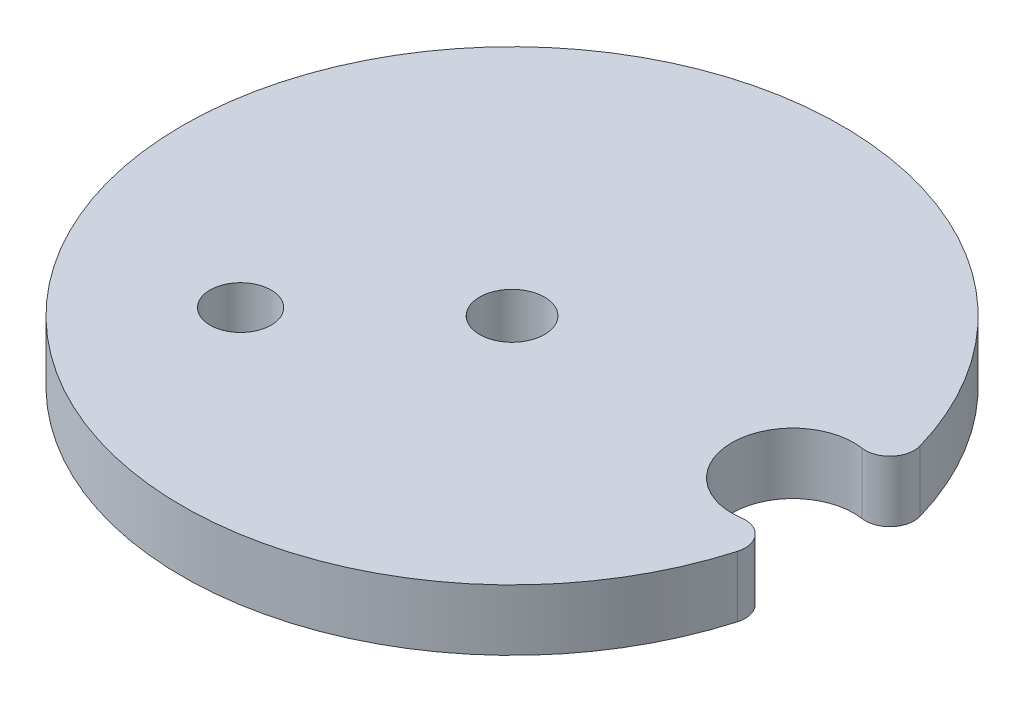
ISO-10303-21;
HEADER;
FILE_DESCRIPTION(('STEP AP214'),'2;1');
FILE_NAME('part.step','',(''),(''),'','','');
FILE_SCHEMA(('AUTOMOTIVE_DESIGN { 1 0 10303 214 1 1 1 1 }'));
ENDSEC;
DATA;
#1=APPLICATION_CONTEXT('core data for automotive mechanical design processes');
#2=APPLICATION_PROTOCOL_DEFINITION('international standard','automotive_design',2000,#1);
#3=PRODUCT_CONTEXT('',#1,'mechanical');
#4=PRODUCT('Part','Part','',(#3));
#5=PRODUCT_RELATED_PRODUCT_CATEGORY('part','',(#4));
#6=PRODUCT_DEFINITION_FORMATION('','',#4);
#7=PRODUCT_DEFINITION_CONTEXT('part definition',#1,'design');
#8=PRODUCT_DEFINITION('design','',#6,#7);
#9=PRODUCT_DEFINITION_SHAPE('','',#8);
#10=(LENGTH_UNIT() NAMED_UNIT(*) SI_UNIT(.MILLI.,.METRE.));
#11=(NAMED_UNIT(*) PLANE_ANGLE_UNIT() SI_UNIT($,.RADIAN.));
#12=(NAMED_UNIT(*) SI_UNIT($,.STERADIAN.) SOLID_ANGLE_UNIT());
#13=UNCERTAINTY_MEASURE_WITH_UNIT(LENGTH_MEASURE(1.E-05),#10,'distance_accuracy_value','');
#14=(GEOMETRIC_REPRESENTATION_CONTEXT(3) GLOBAL_UNCERTAINTY_ASSIGNED_CONTEXT((#13)) GLOBAL_UNIT_ASSIGNED_CONTEXT((#10,
#11,#12)) REPRESENTATION_CONTEXT('',''));
#15=CARTESIAN_POINT('',(0.,0.,0.));
#16=DIRECTION('',(0.,0.,1.));
#17=DIRECTION('',(1.,0.,0.));
#18=AXIS2_PLACEMENT_3D('',#15,#16,#17);
#19=CARTESIAN_POINT('',(29.21,6.35,0.));
#20=DIRECTION('',(0.,-1.,0.));
#21=DIRECTION('',(0.,0.,-1.));
#22=AXIS2_PLACEMENT_3D('',#19,#20,#21);
#23=CYLINDRICAL_SURFACE('',#22,6.35);
#24=CARTESIAN_POINT('',(29.21,6.35,0.));
#25=DIRECTION('',(0.,1.,0.));
#26=DIRECTION('',(0.,0.,1.));
#27=AXIS2_PLACEMENT_3D('',#24,#25,#26);
#28=CIRCLE('',#27,6.35);
#29=CARTESIAN_POINT('',(30.1368633540373,6.35,-6.28199206645016));
#30=VERTEX_POINT('',#29);
#31=CARTESIAN_POINT('',(30.1368633540373,6.35,6.28199206645016));
#32=VERTEX_POINT('',#31);
#33=EDGE_CURVE('E102',#30,#32,#28,.T.);
#34=ORIENTED_EDGE('',*,*,#33,.T.);
#35=DIRECTION('',(0.,-1.,0.));
#36=VECTOR('',#35,1.);
#37=CARTESIAN_POINT('',(30.1368633540373,6.35,6.28199206645016));
#38=LINE('',#37,#36);
#39=CARTESIAN_POINT('',(30.1368633540373,0.,6.28199206645016));
#40=VERTEX_POINT('',#39);
#41=EDGE_CURVE('E90',#32,#40,#38,.T.);
#42=ORIENTED_EDGE('',*,*,#41,.T.);
#43=CARTESIAN_POINT('',(29.21,0.,0.));
#44=DIRECTION('',(0.,1.,0.));
#45=DIRECTION('',(0.,0.,1.));
#46=AXIS2_PLACEMENT_3D('',#43,#44,#45);
#47=CIRCLE('',#46,6.35);
#48=CARTESIAN_POINT('',(30.1368633540373,0.,-6.28199206645016));
#49=VERTEX_POINT('',#48);
#50=EDGE_CURVE('E83',#49,#40,#47,.T.);
#51=ORIENTED_EDGE('',*,*,#50,.F.);
#52=DIRECTION('',(0.,-1.,0.));
#53=VECTOR('',#52,1.);
#54=CARTESIAN_POINT('',(30.1368633540373,6.35,-6.28199206645016));
#55=LINE('',#54,#53);
#56=EDGE_CURVE('E95',#49,#30,#55,.F.);
#57=ORIENTED_EDGE('',*,*,#56,.T.);
#58=EDGE_LOOP('',(#34,#42,#51,#57));
#59=FACE_BOUND('',#58,.T.);
#60=ADVANCED_FACE('F39',(#59),#23,.F.);
#61=CARTESIAN_POINT('',(0.,6.35,0.));
#62=DIRECTION('',(0.,-1.,0.));
#63=DIRECTION('',(0.,0.,-1.));
#64=AXIS2_PLACEMENT_3D('',#61,#62,#63);
#65=CYLINDRICAL_SURFACE('',#64,34.29);
#66=CARTESIAN_POINT('',(0.,0.,0.));
#67=DIRECTION('',(0.,1.,0.));
#68=DIRECTION('',(0.,0.,1.));
#69=AXIS2_PLACEMENT_3D('',#66,#67,#68);
#70=CIRCLE('',#69,34.29);
#71=CARTESIAN_POINT('',(32.9482173913043,0.,-9.49837200447265));
#72=VERTEX_POINT('',#71);
#73=CARTESIAN_POINT('',(32.9482173913043,0.,9.49837200447264));
#74=VERTEX_POINT('',#73);
#75=EDGE_CURVE('E84',#72,#74,#70,.T.);
#76=ORIENTED_EDGE('',*,*,#75,.T.);
#77=DIRECTION('',(0.,-1.,0.));
#78=VECTOR('',#77,1.);
#79=CARTESIAN_POINT('',(32.9482173913044,6.35,9.49837200447265));
#80=LINE('',#79,#78);
#81=CARTESIAN_POINT('',(32.9482173913043,6.35,9.49837200447264));
#82=VERTEX_POINT('',#81);
#83=EDGE_CURVE('E54',#74,#82,#80,.F.);
#84=ORIENTED_EDGE('',*,*,#83,.T.);
#85=CARTESIAN_POINT('',(0.,6.35,0.));
#86=DIRECTION('',(0.,1.,0.));
#87=DIRECTION('',(0.,0.,1.));
#88=AXIS2_PLACEMENT_3D('',#85,#86,#87);
#89=CIRCLE('',#88,34.29);
#90=CARTESIAN_POINT('',(32.9482173913043,6.35,-9.49837200447265));
#91=VERTEX_POINT('',#90);
#92=EDGE_CURVE('E99',#91,#82,#89,.T.);
#93=ORIENTED_EDGE('',*,*,#92,.F.);
#94=DIRECTION('',(0.,-1.,0.));
#95=VECTOR('',#94,1.);
#96=CARTESIAN_POINT('',(32.9482173913044,6.35,-9.49837200447266));
#97=LINE('',#96,#95);
#98=EDGE_CURVE('E107',#91,#72,#97,.T.);
#99=ORIENTED_EDGE('',*,*,#98,.T.);
#100=EDGE_LOOP('',(#76,#84,#93,#99));
#101=FACE_BOUND('',#100,.T.);
#102=ADVANCED_FACE('F109',(#101),#65,.T.);
#103=CARTESIAN_POINT('',(0.,6.35,0.));
#104=DIRECTION('',(0.,1.,0.));
#105=DIRECTION('',(0.,0.,1.));
#106=AXIS2_PLACEMENT_3D('',#103,#104,#105);
#107=PLANE('',#106);
#108=CARTESIAN_POINT('',(-14.8628965095479,6.35,13.3826121271771));
#109=DIRECTION('',(0.,1.,0.));
#110=DIRECTION('',(0.,0.,1.));
#111=AXIS2_PLACEMENT_3D('',#108,#109,#110);
#112=CIRCLE('',#111,3.175);
#113=CARTESIAN_POINT('',(-14.8628965095479,6.35,16.5576121271771));
#114=VERTEX_POINT('',#113);
#115=EDGE_CURVE('E146',#114,#114,#112,.T.);
#116=ORIENTED_EDGE('',*,*,#115,.F.);
#117=EDGE_LOOP('',(#116));
#118=FACE_BOUND('',#117,.T.);
#119=CARTESIAN_POINT('',(0.,6.35,0.));
#120=DIRECTION('',(0.,1.,0.));
#121=DIRECTION('',(0.,0.,1.));
#122=AXIS2_PLACEMENT_3D('',#119,#120,#121);
#123=CIRCLE('',#122,3.37819999999998);
#124=CARTESIAN_POINT('',(0.,6.35,3.37819999999998));
#125=VERTEX_POINT('',#124);
#126=EDGE_CURVE('E148',#125,#125,#123,.T.);
#127=ORIENTED_EDGE('',*,*,#126,.F.);
#128=EDGE_LOOP('',(#127));
#129=FACE_BOUND('',#128,.T.);
#130=ORIENTED_EDGE('',*,*,#92,.T.);
#131=CARTESIAN_POINT('',(30.5076086956522,6.35,8.79478889303023));
#132=DIRECTION('',(0.,1.,0.));
#133=DIRECTION('',(0.,0.,1.));
#134=AXIS2_PLACEMENT_3D('',#131,#132,#133);
#135=CIRCLE('',#134,2.54);
#136=EDGE_CURVE('E11',#82,#32,#135,.T.);
#137=ORIENTED_EDGE('',*,*,#136,.T.);
#138=ORIENTED_EDGE('',*,*,#33,.F.);
#139=CARTESIAN_POINT('',(30.5076086956522,6.35,-8.79478889303024));
#140=DIRECTION('',(0.,1.,0.));
#141=DIRECTION('',(0.,0.,1.));
#142=AXIS2_PLACEMENT_3D('',#139,#140,#141);
#143=CIRCLE('',#142,2.54);
#144=EDGE_CURVE('E47',#30,#91,#143,.T.);
#145=ORIENTED_EDGE('',*,*,#144,.T.);
#146=EDGE_LOOP('',(#130,#137,#138,#145));
#147=FACE_BOUND('',#146,.T.);
#148=ADVANCED_FACE('F111',(#118,#129,#147),#107,.T.);
#149=CARTESIAN_POINT('',(0.,0.,0.));
#150=DIRECTION('',(0.,1.,0.));
#151=DIRECTION('',(0.,0.,1.));
#152=AXIS2_PLACEMENT_3D('',#149,#150,#151);
#153=PLANE('',#152);
#154=CARTESIAN_POINT('',(-14.8628965095479,0.,13.3826121271771));
#155=DIRECTION('',(0.,1.,0.));
#156=DIRECTION('',(0.,0.,1.));
#157=AXIS2_PLACEMENT_3D('',#154,#155,#156);
#158=CIRCLE('',#157,3.175);
#159=CARTESIAN_POINT('',(-14.8628965095479,0.,16.5576121271771));
#160=VERTEX_POINT('',#159);
#161=EDGE_CURVE('E143',#160,#160,#158,.T.);
#162=ORIENTED_EDGE('',*,*,#161,.T.);
#163=EDGE_LOOP('',(#162));
#164=FACE_BOUND('',#163,.T.);
#165=CARTESIAN_POINT('',(0.,0.,0.));
#166=DIRECTION('',(0.,1.,0.));
#167=DIRECTION('',(0.,0.,1.));
#168=AXIS2_PLACEMENT_3D('',#165,#166,#167);
#169=CIRCLE('',#168,3.37819999999998);
#170=CARTESIAN_POINT('',(0.,0.,3.37819999999998));
#171=VERTEX_POINT('',#170);
#172=EDGE_CURVE('E97',#171,#171,#169,.T.);
#173=ORIENTED_EDGE('',*,*,#172,.T.);
#174=EDGE_LOOP('',(#173));
#175=FACE_BOUND('',#174,.T.);
#176=ORIENTED_EDGE('',*,*,#50,.T.);
#177=CARTESIAN_POINT('',(30.5076086956522,0.,8.79478889303023));
#178=DIRECTION('',(0.,1.,0.));
#179=DIRECTION('',(0.,0.,1.));
#180=AXIS2_PLACEMENT_3D('',#177,#178,#179);
#181=CIRCLE('',#180,2.54);
#182=EDGE_CURVE('E89',#40,#74,#181,.F.);
#183=ORIENTED_EDGE('',*,*,#182,.T.);
#184=ORIENTED_EDGE('',*,*,#75,.F.);
#185=CARTESIAN_POINT('',(30.5076086956522,0.,-8.79478889303024));
#186=DIRECTION('',(0.,1.,0.));
#187=DIRECTION('',(0.,0.,1.));
#188=AXIS2_PLACEMENT_3D('',#185,#186,#187);
#189=CIRCLE('',#188,2.54);
#190=EDGE_CURVE('E80',#72,#49,#189,.F.);
#191=ORIENTED_EDGE('',*,*,#190,.T.);
#192=EDGE_LOOP('',(#176,#183,#184,#191));
#193=FACE_BOUND('',#192,.T.);
#194=ADVANCED_FACE('F82',(#164,#175,#193),#153,.F.);
#195=CARTESIAN_POINT('',(0.,6.35,0.));
#196=DIRECTION('',(0.,1.,0.));
#197=DIRECTION('',(0.,0.,1.));
#198=AXIS2_PLACEMENT_3D('',#195,#196,#197);
#199=CYLINDRICAL_SURFACE('',#198,3.37819999999998);
#200=ORIENTED_EDGE('',*,*,#172,.F.);
#201=EDGE_LOOP('',(#200));
#202=FACE_BOUND('',#201,.T.);
#203=ORIENTED_EDGE('',*,*,#126,.T.);
#204=EDGE_LOOP('',(#203));
#205=FACE_BOUND('',#204,.T.);
#206=ADVANCED_FACE('F115',(#202,#205),#199,.F.);
#207=CARTESIAN_POINT('',(30.5076086956522,6.35,8.79478889303023));
#208=DIRECTION('',(0.,1.,0.));
#209=DIRECTION('',(0.,0.,1.));
#210=AXIS2_PLACEMENT_3D('',#207,#208,#209);
#211=CYLINDRICAL_SURFACE('',#210,2.54);
#212=ORIENTED_EDGE('',*,*,#136,.F.);
#213=ORIENTED_EDGE('',*,*,#83,.F.);
#214=ORIENTED_EDGE('',*,*,#182,.F.);
#215=ORIENTED_EDGE('',*,*,#41,.F.);
#216=EDGE_LOOP('',(#212,#213,#214,#215));
#217=FACE_BOUND('',#216,.T.);
#218=ADVANCED_FACE('F113',(#217),#211,.T.);
#219=CARTESIAN_POINT('',(30.5076086956522,6.35,-8.79478889303024));
#220=DIRECTION('',(0.,1.,0.));
#221=DIRECTION('',(0.,0.,1.));
#222=AXIS2_PLACEMENT_3D('',#219,#220,#221);
#223=CYLINDRICAL_SURFACE('',#222,2.54);
#224=ORIENTED_EDGE('',*,*,#144,.F.);
#225=ORIENTED_EDGE('',*,*,#56,.F.);
#226=ORIENTED_EDGE('',*,*,#190,.F.);
#227=ORIENTED_EDGE('',*,*,#98,.F.);
#228=EDGE_LOOP('',(#224,#225,#226,#227));
#229=FACE_BOUND('',#228,.T.);
#230=ADVANCED_FACE('F41',(#229),#223,.T.);
#231=CARTESIAN_POINT('',(-14.8628965095479,0.,13.3826121271771));
#232=DIRECTION('',(0.,1.,0.));
#233=DIRECTION('',(0.,0.,1.));
#234=AXIS2_PLACEMENT_3D('',#231,#232,#233);
#235=CYLINDRICAL_SURFACE('',#234,3.175);
#236=ORIENTED_EDGE('',*,*,#161,.F.);
#237=EDGE_LOOP('',(#236));
#238=FACE_BOUND('',#237,.T.);
#239=ORIENTED_EDGE('',*,*,#115,.T.);
#240=EDGE_LOOP('',(#239));
#241=FACE_BOUND('',#240,.T.);
#242=ADVANCED_FACE('F120',(#238,#241),#235,.F.);
#243=CLOSED_SHELL('',(#60,#102,#148,#194,#206,#218,#230,#242));
#244=MANIFOLD_SOLID_BREP('B2',#243);
#245=ADVANCED_BREP_SHAPE_REPRESENTATION('',(#18,#244),#14);
#246=SHAPE_DEFINITION_REPRESENTATION(#9,#245);
ENDSEC;
END-ISO-10303-21;
